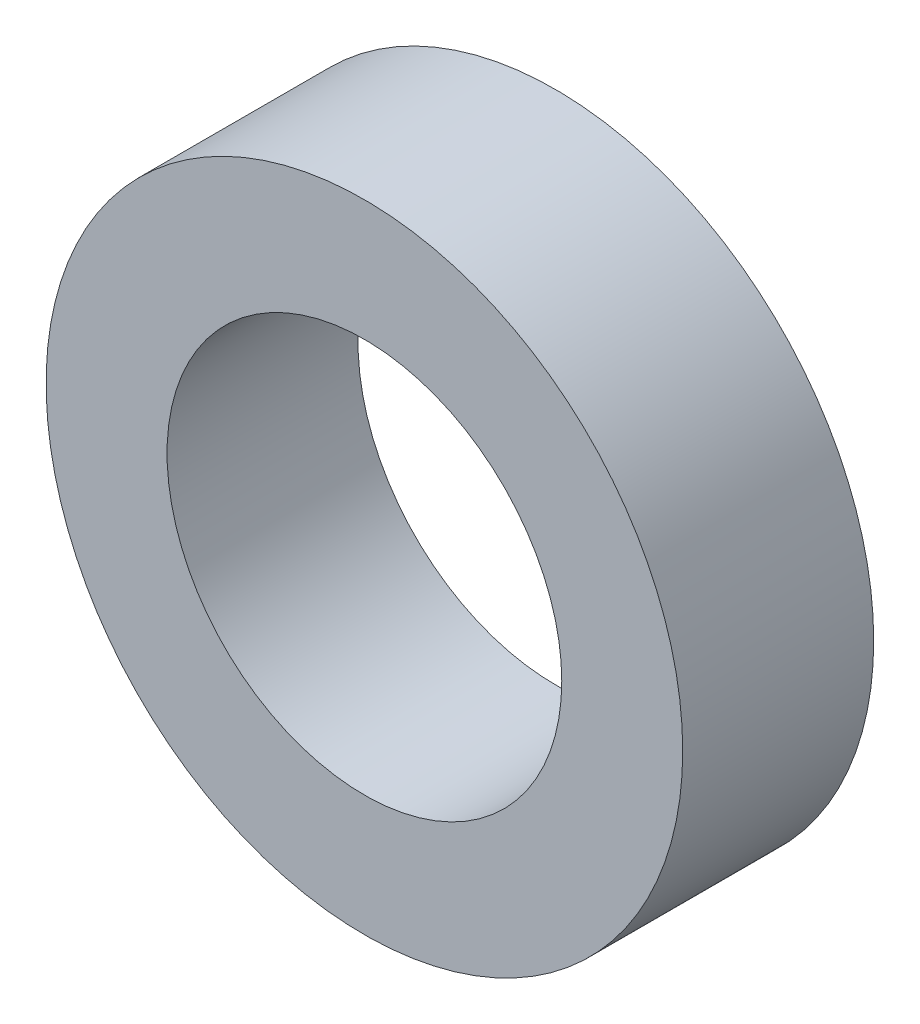
ISO-10303-21;
HEADER;
FILE_DESCRIPTION(('STEP AP214'),'2;1');
FILE_NAME('part.step','',(''),(''),'','','');
FILE_SCHEMA(('AUTOMOTIVE_DESIGN { 1 0 10303 214 1 1 1 1 }'));
ENDSEC;
DATA;
#1=APPLICATION_CONTEXT('core data for automotive mechanical design processes');
#2=APPLICATION_PROTOCOL_DEFINITION('international standard','automotive_design',2000,#1);
#3=PRODUCT_CONTEXT('',#1,'mechanical');
#4=PRODUCT('Part','Part','',(#3));
#5=PRODUCT_RELATED_PRODUCT_CATEGORY('part','',(#4));
#6=PRODUCT_DEFINITION_FORMATION('','',#4);
#7=PRODUCT_DEFINITION_CONTEXT('part definition',#1,'design');
#8=PRODUCT_DEFINITION('design','',#6,#7);
#9=PRODUCT_DEFINITION_SHAPE('','',#8);
#10=(LENGTH_UNIT() NAMED_UNIT(*) SI_UNIT(.MILLI.,.METRE.));
#11=(NAMED_UNIT(*) PLANE_ANGLE_UNIT() SI_UNIT($,.RADIAN.));
#12=(NAMED_UNIT(*) SI_UNIT($,.STERADIAN.) SOLID_ANGLE_UNIT());
#13=UNCERTAINTY_MEASURE_WITH_UNIT(LENGTH_MEASURE(1.E-05),#10,'distance_accuracy_value','');
#14=(GEOMETRIC_REPRESENTATION_CONTEXT(3) GLOBAL_UNCERTAINTY_ASSIGNED_CONTEXT((#13)) GLOBAL_UNIT_ASSIGNED_CONTEXT((#10,
#11,#12)) REPRESENTATION_CONTEXT('',''));
#15=CARTESIAN_POINT('',(0.,0.,0.));
#16=DIRECTION('',(0.,0.,1.));
#17=DIRECTION('',(1.,0.,0.));
#18=AXIS2_PLACEMENT_3D('',#15,#16,#17);
#19=CARTESIAN_POINT('',(0.,0.,3.));
#20=DIRECTION('',(0.,0.,1.));
#21=DIRECTION('',(1.,0.,0.));
#22=AXIS2_PLACEMENT_3D('',#19,#20,#21);
#23=PLANE('',#22);
#24=CARTESIAN_POINT('',(0.,0.,3.));
#25=DIRECTION('',(0.,0.,1.));
#26=DIRECTION('',(1.,0.,0.));
#27=AXIS2_PLACEMENT_3D('',#24,#25,#26);
#28=CIRCLE('',#27,5.);
#29=CARTESIAN_POINT('',(5.,0.,3.));
#30=VERTEX_POINT('',#29);
#31=EDGE_CURVE('E10',#30,#30,#28,.T.);
#32=ORIENTED_EDGE('',*,*,#31,.T.);
#33=EDGE_LOOP('',(#32));
#34=FACE_BOUND('',#33,.T.);
#35=CARTESIAN_POINT('',(0.,0.,3.));
#36=DIRECTION('',(0.,0.,1.));
#37=DIRECTION('',(1.,0.,0.));
#38=AXIS2_PLACEMENT_3D('',#35,#36,#37);
#39=CIRCLE('',#38,3.1);
#40=CARTESIAN_POINT('',(3.1,0.,3.));
#41=VERTEX_POINT('',#40);
#42=EDGE_CURVE('E42',#41,#41,#39,.T.);
#43=ORIENTED_EDGE('',*,*,#42,.F.);
#44=EDGE_LOOP('',(#43));
#45=FACE_BOUND('',#44,.T.);
#46=ADVANCED_FACE('F31',(#34,#45),#23,.T.);
#47=CARTESIAN_POINT('',(0.,0.,0.));
#48=DIRECTION('',(0.,0.,1.));
#49=DIRECTION('',(1.,0.,0.));
#50=AXIS2_PLACEMENT_3D('',#47,#48,#49);
#51=PLANE('',#50);
#52=CARTESIAN_POINT('',(0.,0.,0.));
#53=DIRECTION('',(0.,0.,1.));
#54=DIRECTION('',(1.,0.,0.));
#55=AXIS2_PLACEMENT_3D('',#52,#53,#54);
#56=CIRCLE('',#55,5.);
#57=CARTESIAN_POINT('',(5.,0.,0.));
#58=VERTEX_POINT('',#57);
#59=EDGE_CURVE('E35',#58,#58,#56,.T.);
#60=ORIENTED_EDGE('',*,*,#59,.F.);
#61=EDGE_LOOP('',(#60));
#62=FACE_BOUND('',#61,.T.);
#63=CARTESIAN_POINT('',(0.,0.,0.));
#64=DIRECTION('',(0.,0.,1.));
#65=DIRECTION('',(1.,0.,0.));
#66=AXIS2_PLACEMENT_3D('',#63,#64,#65);
#67=CIRCLE('',#66,3.1);
#68=CARTESIAN_POINT('',(3.1,0.,0.));
#69=VERTEX_POINT('',#68);
#70=EDGE_CURVE('E44',#69,#69,#67,.T.);
#71=ORIENTED_EDGE('',*,*,#70,.T.);
#72=EDGE_LOOP('',(#71));
#73=FACE_BOUND('',#72,.T.);
#74=ADVANCED_FACE('F54',(#62,#73),#51,.F.);
#75=CARTESIAN_POINT('',(0.,0.,3.));
#76=DIRECTION('',(0.,0.,-1.));
#77=DIRECTION('',(-1.,0.,0.));
#78=AXIS2_PLACEMENT_3D('',#75,#76,#77);
#79=CYLINDRICAL_SURFACE('',#78,5.);
#80=ORIENTED_EDGE('',*,*,#31,.F.);
#81=EDGE_LOOP('',(#80));
#82=FACE_BOUND('',#81,.T.);
#83=ORIENTED_EDGE('',*,*,#59,.T.);
#84=EDGE_LOOP('',(#83));
#85=FACE_BOUND('',#84,.T.);
#86=ADVANCED_FACE('F33',(#82,#85),#79,.T.);
#87=CARTESIAN_POINT('',(0.,0.,3.));
#88=DIRECTION('',(0.,0.,-1.));
#89=DIRECTION('',(-1.,0.,0.));
#90=AXIS2_PLACEMENT_3D('',#87,#88,#89);
#91=CYLINDRICAL_SURFACE('',#90,3.1);
#92=ORIENTED_EDGE('',*,*,#42,.T.);
#93=EDGE_LOOP('',(#92));
#94=FACE_BOUND('',#93,.T.);
#95=ORIENTED_EDGE('',*,*,#70,.F.);
#96=EDGE_LOOP('',(#95));
#97=FACE_BOUND('',#96,.T.);
#98=ADVANCED_FACE('F50',(#94,#97),#91,.F.);
#99=CLOSED_SHELL('',(#46,#74,#86,#98));
#100=MANIFOLD_SOLID_BREP('B2',#99);
#101=ADVANCED_BREP_SHAPE_REPRESENTATION('',(#18,#100),#14);
#102=SHAPE_DEFINITION_REPRESENTATION(#9,#101);
ENDSEC;
END-ISO-10303-21;
